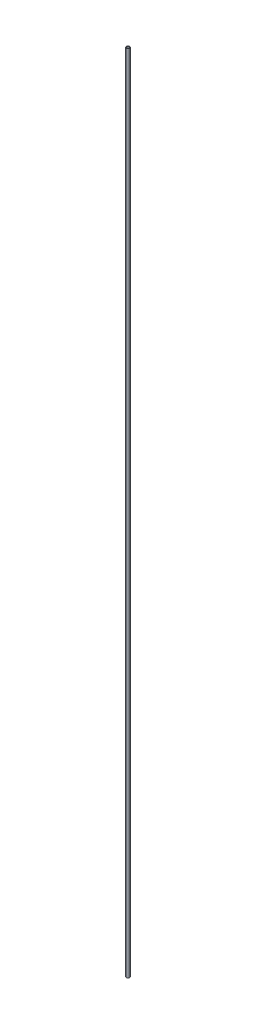
ISO-10303-21;
HEADER;
FILE_DESCRIPTION(('STEP AP214'),'2;1');
FILE_NAME('part.step','',(''),(''),'','','');
FILE_SCHEMA(('AUTOMOTIVE_DESIGN { 1 0 10303 214 1 1 1 1 }'));
ENDSEC;
DATA;
#1=APPLICATION_CONTEXT('core data for automotive mechanical design processes');
#2=APPLICATION_PROTOCOL_DEFINITION('international standard','automotive_design',2000,#1);
#3=PRODUCT_CONTEXT('',#1,'mechanical');
#4=PRODUCT('Part','Part','',(#3));
#5=PRODUCT_RELATED_PRODUCT_CATEGORY('part','',(#4));
#6=PRODUCT_DEFINITION_FORMATION('','',#4);
#7=PRODUCT_DEFINITION_CONTEXT('part definition',#1,'design');
#8=PRODUCT_DEFINITION('design','',#6,#7);
#9=PRODUCT_DEFINITION_SHAPE('','',#8);
#10=(LENGTH_UNIT() NAMED_UNIT(*) SI_UNIT(.MILLI.,.METRE.));
#11=(NAMED_UNIT(*) PLANE_ANGLE_UNIT() SI_UNIT($,.RADIAN.));
#12=(NAMED_UNIT(*) SI_UNIT($,.STERADIAN.) SOLID_ANGLE_UNIT());
#13=UNCERTAINTY_MEASURE_WITH_UNIT(LENGTH_MEASURE(1.E-05),#10,'distance_accuracy_value','');
#14=(GEOMETRIC_REPRESENTATION_CONTEXT(3) GLOBAL_UNCERTAINTY_ASSIGNED_CONTEXT((#13)) GLOBAL_UNIT_ASSIGNED_CONTEXT((#10,
#11,#12)) REPRESENTATION_CONTEXT('',''));
#15=CARTESIAN_POINT('',(0.,0.,0.));
#16=DIRECTION('',(0.,0.,1.));
#17=DIRECTION('',(1.,0.,0.));
#18=AXIS2_PLACEMENT_3D('',#15,#16,#17);
#19=CARTESIAN_POINT('',(0.,1000.,0.));
#20=DIRECTION('',(0.,1.,0.));
#21=DIRECTION('',(0.,0.,1.));
#22=AXIS2_PLACEMENT_3D('',#19,#20,#21);
#23=PLANE('',#22);
#24=CARTESIAN_POINT('',(0.,1000.,0.));
#25=DIRECTION('',(0.,1.,0.));
#26=DIRECTION('',(0.,0.,1.));
#27=AXIS2_PLACEMENT_3D('',#24,#25,#26);
#28=CIRCLE('',#27,2.);
#29=CARTESIAN_POINT('',(0.,1000.,2.));
#30=VERTEX_POINT('',#29);
#31=EDGE_CURVE('E10',#30,#30,#28,.T.);
#32=ORIENTED_EDGE('',*,*,#31,.T.);
#33=EDGE_LOOP('',(#32));
#34=FACE_BOUND('',#33,.T.);
#35=CARTESIAN_POINT('',(0.,1000.,0.));
#36=DIRECTION('',(0.,1.,0.));
#37=DIRECTION('',(0.,0.,1.));
#38=AXIS2_PLACEMENT_3D('',#35,#36,#37);
#39=CIRCLE('',#38,1.5);
#40=CARTESIAN_POINT('',(0.,1000.,1.5));
#41=VERTEX_POINT('',#40);
#42=EDGE_CURVE('E47',#41,#41,#39,.T.);
#43=ORIENTED_EDGE('',*,*,#42,.F.);
#44=EDGE_LOOP('',(#43));
#45=FACE_BOUND('',#44,.T.);
#46=ADVANCED_FACE('F36',(#34,#45),#23,.T.);
#47=CARTESIAN_POINT('',(0.,0.,0.));
#48=DIRECTION('',(0.,1.,0.));
#49=DIRECTION('',(0.,0.,1.));
#50=AXIS2_PLACEMENT_3D('',#47,#48,#49);
#51=PLANE('',#50);
#52=CARTESIAN_POINT('',(0.,0.,0.));
#53=DIRECTION('',(0.,1.,0.));
#54=DIRECTION('',(0.,0.,1.));
#55=AXIS2_PLACEMENT_3D('',#52,#53,#54);
#56=CIRCLE('',#55,2.);
#57=CARTESIAN_POINT('',(0.,0.,2.));
#58=VERTEX_POINT('',#57);
#59=EDGE_CURVE('E40',#58,#58,#56,.T.);
#60=ORIENTED_EDGE('',*,*,#59,.F.);
#61=EDGE_LOOP('',(#60));
#62=FACE_BOUND('',#61,.T.);
#63=CARTESIAN_POINT('',(0.,0.,0.));
#64=DIRECTION('',(0.,1.,0.));
#65=DIRECTION('',(0.,0.,1.));
#66=AXIS2_PLACEMENT_3D('',#63,#64,#65);
#67=CIRCLE('',#66,1.5);
#68=CARTESIAN_POINT('',(0.,0.,1.5));
#69=VERTEX_POINT('',#68);
#70=EDGE_CURVE('E49',#69,#69,#67,.T.);
#71=ORIENTED_EDGE('',*,*,#70,.T.);
#72=EDGE_LOOP('',(#71));
#73=FACE_BOUND('',#72,.T.);
#74=ADVANCED_FACE('F59',(#62,#73),#51,.F.);
#75=CARTESIAN_POINT('',(0.,1000.,0.));
#76=DIRECTION('',(0.,-1.,0.));
#77=DIRECTION('',(0.,0.,-1.));
#78=AXIS2_PLACEMENT_3D('',#75,#76,#77);
#79=CYLINDRICAL_SURFACE('',#78,2.);
#80=ORIENTED_EDGE('',*,*,#31,.F.);
#81=EDGE_LOOP('',(#80));
#82=FACE_BOUND('',#81,.T.);
#83=ORIENTED_EDGE('',*,*,#59,.T.);
#84=EDGE_LOOP('',(#83));
#85=FACE_BOUND('',#84,.T.);
#86=ADVANCED_FACE('F38',(#82,#85),#79,.T.);
#87=CARTESIAN_POINT('',(0.,1000.,0.));
#88=DIRECTION('',(0.,-1.,0.));
#89=DIRECTION('',(0.,0.,-1.));
#90=AXIS2_PLACEMENT_3D('',#87,#88,#89);
#91=CYLINDRICAL_SURFACE('',#90,1.5);
#92=ORIENTED_EDGE('',*,*,#42,.T.);
#93=EDGE_LOOP('',(#92));
#94=FACE_BOUND('',#93,.T.);
#95=ORIENTED_EDGE('',*,*,#70,.F.);
#96=EDGE_LOOP('',(#95));
#97=FACE_BOUND('',#96,.T.);
#98=ADVANCED_FACE('F55',(#94,#97),#91,.F.);
#99=CLOSED_SHELL('',(#46,#74,#86,#98));
#100=MANIFOLD_SOLID_BREP('B2',#99);
#101=ADVANCED_BREP_SHAPE_REPRESENTATION('',(#18,#100),#14);
#102=SHAPE_DEFINITION_REPRESENTATION(#9,#101);
ENDSEC;
END-ISO-10303-21;
